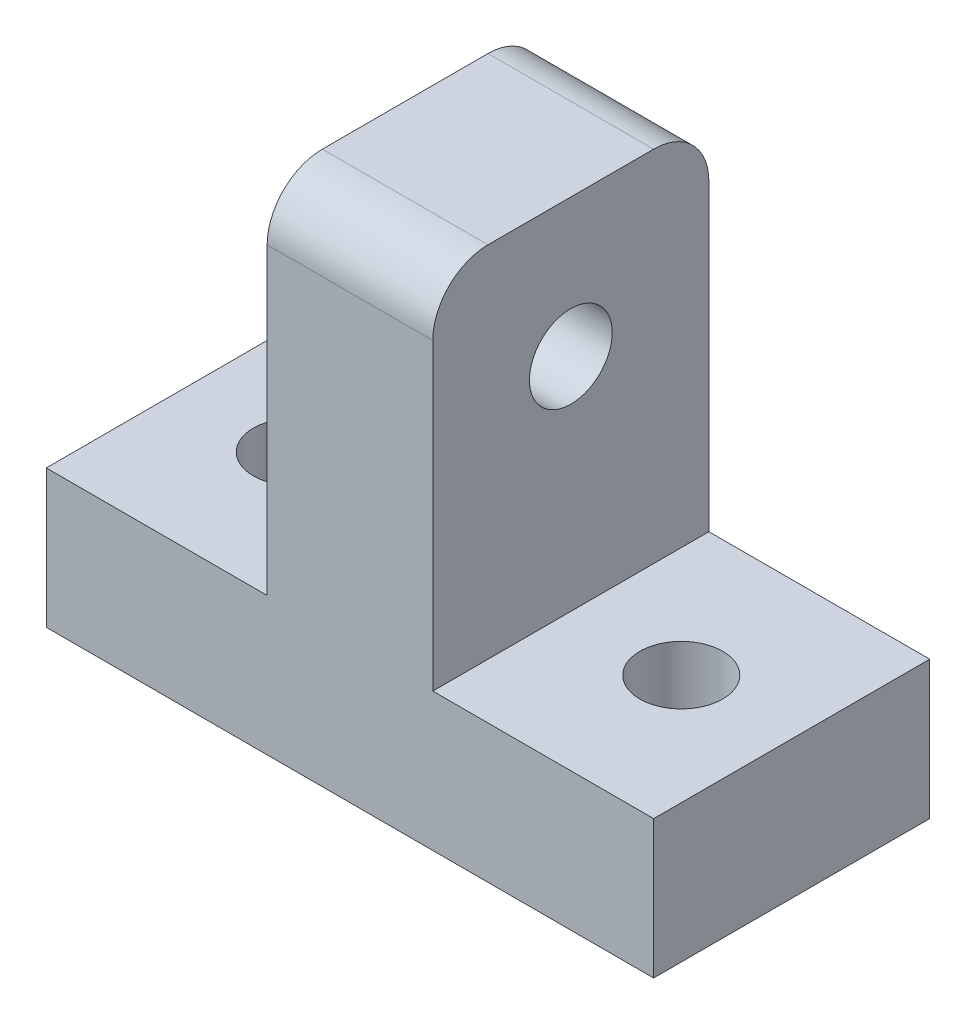
ISO-10303-21;
HEADER;
FILE_DESCRIPTION(('STEP AP214'),'2;1');
FILE_NAME('part.step','',(''),(''),'','','');
FILE_SCHEMA(('AUTOMOTIVE_DESIGN { 1 0 10303 214 1 1 1 1 }'));
ENDSEC;
DATA;
#1=APPLICATION_CONTEXT('core data for automotive mechanical design processes');
#2=APPLICATION_PROTOCOL_DEFINITION('international standard','automotive_design',2000,#1);
#3=PRODUCT_CONTEXT('',#1,'mechanical');
#4=PRODUCT('Part','Part','',(#3));
#5=PRODUCT_RELATED_PRODUCT_CATEGORY('part','',(#4));
#6=PRODUCT_DEFINITION_FORMATION('','',#4);
#7=PRODUCT_DEFINITION_CONTEXT('part definition',#1,'design');
#8=PRODUCT_DEFINITION('design','',#6,#7);
#9=PRODUCT_DEFINITION_SHAPE('','',#8);
#10=(LENGTH_UNIT() NAMED_UNIT(*) SI_UNIT(.MILLI.,.METRE.));
#11=(NAMED_UNIT(*) PLANE_ANGLE_UNIT() SI_UNIT($,.RADIAN.));
#12=(NAMED_UNIT(*) SI_UNIT($,.STERADIAN.) SOLID_ANGLE_UNIT());
#13=UNCERTAINTY_MEASURE_WITH_UNIT(LENGTH_MEASURE(1.E-05),#10,'distance_accuracy_value','');
#14=(GEOMETRIC_REPRESENTATION_CONTEXT(3) GLOBAL_UNCERTAINTY_ASSIGNED_CONTEXT((#13)) GLOBAL_UNIT_ASSIGNED_CONTEXT((#10,
#11,#12)) REPRESENTATION_CONTEXT('',''));
#15=CARTESIAN_POINT('',(0.,0.,0.));
#16=DIRECTION('',(0.,0.,1.));
#17=DIRECTION('',(1.,0.,0.));
#18=AXIS2_PLACEMENT_3D('',#15,#16,#17);
#19=CARTESIAN_POINT('',(0.,5.,0.));
#20=DIRECTION('',(0.,-1.,0.));
#21=DIRECTION('',(0.,0.,-1.));
#22=AXIS2_PLACEMENT_3D('',#19,#20,#21);
#23=PLANE('',#22);
#24=CARTESIAN_POINT('',(7.,5.,0.));
#25=DIRECTION('',(0.,1.,0.));
#26=DIRECTION('',(0.,0.,1.));
#27=AXIS2_PLACEMENT_3D('',#24,#25,#26);
#28=CIRCLE('',#27,1.5);
#29=CARTESIAN_POINT('',(7.,5.,1.5));
#30=VERTEX_POINT('',#29);
#31=EDGE_CURVE('E150',#30,#30,#28,.T.);
#32=ORIENTED_EDGE('',*,*,#31,.F.);
#33=EDGE_LOOP('',(#32));
#34=FACE_BOUND('',#33,.T.);
#35=DIRECTION('',(0.,0.,-1.));
#36=VECTOR('',#35,1.);
#37=CARTESIAN_POINT('',(3.,5.,5.));
#38=LINE('',#37,#36);
#39=CARTESIAN_POINT('',(3.,5.,5.));
#40=VERTEX_POINT('',#39);
#41=CARTESIAN_POINT('',(3.,5.,-5.));
#42=VERTEX_POINT('',#41);
#43=EDGE_CURVE('E135',#40,#42,#38,.T.);
#44=ORIENTED_EDGE('',*,*,#43,.F.);
#45=DIRECTION('',(1.,0.,0.));
#46=VECTOR('',#45,1.);
#47=CARTESIAN_POINT('',(-11.,5.,5.));
#48=LINE('',#47,#46);
#49=CARTESIAN_POINT('',(11.,5.,5.));
#50=VERTEX_POINT('',#49);
#51=EDGE_CURVE('E130',#40,#50,#48,.T.);
#52=ORIENTED_EDGE('',*,*,#51,.T.);
#53=DIRECTION('',(0.,0.,-1.));
#54=VECTOR('',#53,1.);
#55=CARTESIAN_POINT('',(11.,5.,5.));
#56=LINE('',#55,#54);
#57=CARTESIAN_POINT('',(11.,5.,-5.));
#58=VERTEX_POINT('',#57);
#59=EDGE_CURVE('E162',#50,#58,#56,.T.);
#60=ORIENTED_EDGE('',*,*,#59,.T.);
#61=DIRECTION('',(-1.,0.,0.));
#62=VECTOR('',#61,1.);
#63=CARTESIAN_POINT('',(-11.,5.,-5.));
#64=LINE('',#63,#62);
#65=EDGE_CURVE('E167',#58,#42,#64,.T.);
#66=ORIENTED_EDGE('',*,*,#65,.T.);
#67=EDGE_LOOP('',(#44,#52,#60,#66));
#68=FACE_BOUND('',#67,.T.);
#69=ADVANCED_FACE('F32',(#34,#68),#23,.F.);
#70=CARTESIAN_POINT('',(-7.,5.,0.));
#71=DIRECTION('',(0.,1.,0.));
#72=DIRECTION('',(0.,0.,1.));
#73=AXIS2_PLACEMENT_3D('',#70,#71,#72);
#74=CIRCLE('',#73,1.5);
#75=CARTESIAN_POINT('',(-7.,5.,1.5));
#76=VERTEX_POINT('',#75);
#77=EDGE_CURVE('E156',#76,#76,#74,.T.);
#78=ORIENTED_EDGE('',*,*,#77,.F.);
#79=EDGE_LOOP('',(#78));
#80=FACE_BOUND('',#79,.T.);
#81=DIRECTION('',(0.,0.,1.));
#82=VECTOR('',#81,1.);
#83=CARTESIAN_POINT('',(-3.,5.,5.));
#84=LINE('',#83,#82);
#85=CARTESIAN_POINT('',(-3.,5.,-5.));
#86=VERTEX_POINT('',#85);
#87=CARTESIAN_POINT('',(-3.,5.,5.));
#88=VERTEX_POINT('',#87);
#89=EDGE_CURVE('E124',#86,#88,#84,.T.);
#90=ORIENTED_EDGE('',*,*,#89,.F.);
#91=CARTESIAN_POINT('',(-11.,5.,-5.));
#92=VERTEX_POINT('',#91);
#93=EDGE_CURVE('E165',#86,#92,#64,.T.);
#94=ORIENTED_EDGE('',*,*,#93,.T.);
#95=DIRECTION('',(0.,0.,1.));
#96=VECTOR('',#95,1.);
#97=CARTESIAN_POINT('',(-11.,5.,5.));
#98=LINE('',#97,#96);
#99=CARTESIAN_POINT('',(-11.,5.,5.));
#100=VERTEX_POINT('',#99);
#101=EDGE_CURVE('E127',#92,#100,#98,.T.);
#102=ORIENTED_EDGE('',*,*,#101,.T.);
#103=EDGE_CURVE('E113',#100,#88,#48,.T.);
#104=ORIENTED_EDGE('',*,*,#103,.T.);
#105=EDGE_LOOP('',(#90,#94,#102,#104));
#106=FACE_BOUND('',#105,.T.);
#107=ADVANCED_FACE('F123',(#80,#106),#23,.F.);
#108=CARTESIAN_POINT('',(0.,0.,0.));
#109=DIRECTION('',(0.,-1.,0.));
#110=DIRECTION('',(0.,0.,-1.));
#111=AXIS2_PLACEMENT_3D('',#108,#109,#110);
#112=PLANE('',#111);
#113=CARTESIAN_POINT('',(-7.,0.,0.));
#114=DIRECTION('',(0.,1.,0.));
#115=DIRECTION('',(0.,0.,1.));
#116=AXIS2_PLACEMENT_3D('',#113,#114,#115);
#117=CIRCLE('',#116,1.5);
#118=CARTESIAN_POINT('',(-7.,0.,1.5));
#119=VERTEX_POINT('',#118);
#120=EDGE_CURVE('E153',#119,#119,#117,.T.);
#121=ORIENTED_EDGE('',*,*,#120,.T.);
#122=EDGE_LOOP('',(#121));
#123=FACE_BOUND('',#122,.T.);
#124=DIRECTION('',(0.,0.,-1.));
#125=VECTOR('',#124,1.);
#126=CARTESIAN_POINT('',(11.,0.,5.));
#127=LINE('',#126,#125);
#128=CARTESIAN_POINT('',(11.,0.,5.));
#129=VERTEX_POINT('',#128);
#130=CARTESIAN_POINT('',(11.,0.,-5.));
#131=VERTEX_POINT('',#130);
#132=EDGE_CURVE('E159',#129,#131,#127,.T.);
#133=ORIENTED_EDGE('',*,*,#132,.F.);
#134=DIRECTION('',(1.,0.,0.));
#135=VECTOR('',#134,1.);
#136=CARTESIAN_POINT('',(-11.,0.,5.));
#137=LINE('',#136,#135);
#138=CARTESIAN_POINT('',(-11.,0.,5.));
#139=VERTEX_POINT('',#138);
#140=EDGE_CURVE('E166',#139,#129,#137,.T.);
#141=ORIENTED_EDGE('',*,*,#140,.F.);
#142=DIRECTION('',(0.,0.,1.));
#143=VECTOR('',#142,1.);
#144=CARTESIAN_POINT('',(-11.,0.,5.));
#145=LINE('',#144,#143);
#146=CARTESIAN_POINT('',(-11.,0.,-5.));
#147=VERTEX_POINT('',#146);
#148=EDGE_CURVE('E175',#147,#139,#145,.T.);
#149=ORIENTED_EDGE('',*,*,#148,.F.);
#150=DIRECTION('',(-1.,0.,0.));
#151=VECTOR('',#150,1.);
#152=CARTESIAN_POINT('',(-11.,0.,-5.));
#153=LINE('',#152,#151);
#154=EDGE_CURVE('E173',#131,#147,#153,.T.);
#155=ORIENTED_EDGE('',*,*,#154,.F.);
#156=EDGE_LOOP('',(#133,#141,#149,#155));
#157=FACE_BOUND('',#156,.T.);
#158=CARTESIAN_POINT('',(7.,0.,0.));
#159=DIRECTION('',(0.,1.,0.));
#160=DIRECTION('',(0.,0.,1.));
#161=AXIS2_PLACEMENT_3D('',#158,#159,#160);
#162=CIRCLE('',#161,1.5);
#163=CARTESIAN_POINT('',(7.,0.,1.5));
#164=VERTEX_POINT('',#163);
#165=EDGE_CURVE('E149',#164,#164,#162,.T.);
#166=ORIENTED_EDGE('',*,*,#165,.T.);
#167=EDGE_LOOP('',(#166));
#168=FACE_BOUND('',#167,.T.);
#169=ADVANCED_FACE('F217',(#123,#157,#168),#112,.T.);
#170=CARTESIAN_POINT('',(11.,5.,5.));
#171=DIRECTION('',(-1.,0.,0.));
#172=DIRECTION('',(0.,0.,1.));
#173=AXIS2_PLACEMENT_3D('',#170,#171,#172);
#174=PLANE('',#173);
#175=ORIENTED_EDGE('',*,*,#132,.T.);
#176=DIRECTION('',(0.,-1.,0.));
#177=VECTOR('',#176,1.);
#178=CARTESIAN_POINT('',(11.,5.,-5.));
#179=LINE('',#178,#177);
#180=EDGE_CURVE('E185',#58,#131,#179,.T.);
#181=ORIENTED_EDGE('',*,*,#180,.F.);
#182=ORIENTED_EDGE('',*,*,#59,.F.);
#183=DIRECTION('',(0.,-1.,0.));
#184=VECTOR('',#183,1.);
#185=CARTESIAN_POINT('',(11.,5.,5.));
#186=LINE('',#185,#184);
#187=EDGE_CURVE('E129',#50,#129,#186,.T.);
#188=ORIENTED_EDGE('',*,*,#187,.T.);
#189=EDGE_LOOP('',(#175,#181,#182,#188));
#190=FACE_BOUND('',#189,.T.);
#191=ADVANCED_FACE('F221',(#190),#174,.F.);
#192=CARTESIAN_POINT('',(-11.,5.,-5.));
#193=DIRECTION('',(0.,0.,1.));
#194=DIRECTION('',(1.,0.,0.));
#195=AXIS2_PLACEMENT_3D('',#192,#193,#194);
#196=PLANE('',#195);
#197=DIRECTION('',(0.,-1.,0.));
#198=VECTOR('',#197,1.);
#199=CARTESIAN_POINT('',(-3.,18.,-5.));
#200=LINE('',#199,#198);
#201=CARTESIAN_POINT('',(-3.,16.,-5.));
#202=VERTEX_POINT('',#201);
#203=EDGE_CURVE('E118',#202,#86,#200,.T.);
#204=ORIENTED_EDGE('',*,*,#203,.F.);
#205=DIRECTION('',(-1.,0.,0.));
#206=VECTOR('',#205,1.);
#207=CARTESIAN_POINT('',(-11.,16.,-5.));
#208=LINE('',#207,#206);
#209=CARTESIAN_POINT('',(3.,16.,-5.));
#210=VERTEX_POINT('',#209);
#211=EDGE_CURVE('E55',#202,#210,#208,.F.);
#212=ORIENTED_EDGE('',*,*,#211,.T.);
#213=DIRECTION('',(0.,-1.,0.));
#214=VECTOR('',#213,1.);
#215=CARTESIAN_POINT('',(3.,18.,-5.));
#216=LINE('',#215,#214);
#217=EDGE_CURVE('E147',#210,#42,#216,.T.);
#218=ORIENTED_EDGE('',*,*,#217,.T.);
#219=ORIENTED_EDGE('',*,*,#65,.F.);
#220=ORIENTED_EDGE('',*,*,#180,.T.);
#221=ORIENTED_EDGE('',*,*,#154,.T.);
#222=DIRECTION('',(0.,-1.,0.));
#223=VECTOR('',#222,1.);
#224=CARTESIAN_POINT('',(-11.,5.,-5.));
#225=LINE('',#224,#223);
#226=EDGE_CURVE('E182',#92,#147,#225,.T.);
#227=ORIENTED_EDGE('',*,*,#226,.F.);
#228=ORIENTED_EDGE('',*,*,#93,.F.);
#229=EDGE_LOOP('',(#204,#212,#218,#219,#220,#221,#227,#228));
#230=FACE_BOUND('',#229,.T.);
#231=ADVANCED_FACE('F208',(#230),#196,.F.);
#232=CARTESIAN_POINT('',(-11.,5.,5.));
#233=DIRECTION('',(1.,0.,0.));
#234=DIRECTION('',(0.,0.,-1.));
#235=AXIS2_PLACEMENT_3D('',#232,#233,#234);
#236=PLANE('',#235);
#237=ORIENTED_EDGE('',*,*,#148,.T.);
#238=DIRECTION('',(0.,-1.,0.));
#239=VECTOR('',#238,1.);
#240=CARTESIAN_POINT('',(-11.,5.,5.));
#241=LINE('',#240,#239);
#242=EDGE_CURVE('E180',#100,#139,#241,.T.);
#243=ORIENTED_EDGE('',*,*,#242,.F.);
#244=ORIENTED_EDGE('',*,*,#101,.F.);
#245=ORIENTED_EDGE('',*,*,#226,.T.);
#246=EDGE_LOOP('',(#237,#243,#244,#245));
#247=FACE_BOUND('',#246,.T.);
#248=ADVANCED_FACE('F212',(#247),#236,.F.);
#249=CARTESIAN_POINT('',(-11.,5.,5.));
#250=DIRECTION('',(0.,0.,-1.));
#251=DIRECTION('',(-1.,0.,0.));
#252=AXIS2_PLACEMENT_3D('',#249,#250,#251);
#253=PLANE('',#252);
#254=DIRECTION('',(0.,-1.,0.));
#255=VECTOR('',#254,1.);
#256=CARTESIAN_POINT('',(3.,18.,5.));
#257=LINE('',#256,#255);
#258=CARTESIAN_POINT('',(3.,16.,5.));
#259=VERTEX_POINT('',#258);
#260=EDGE_CURVE('E119',#259,#40,#257,.T.);
#261=ORIENTED_EDGE('',*,*,#260,.F.);
#262=DIRECTION('',(1.,0.,0.));
#263=VECTOR('',#262,1.);
#264=CARTESIAN_POINT('',(-11.,16.,5.));
#265=LINE('',#264,#263);
#266=CARTESIAN_POINT('',(-3.,16.,5.));
#267=VERTEX_POINT('',#266);
#268=EDGE_CURVE('E11',#259,#267,#265,.F.);
#269=ORIENTED_EDGE('',*,*,#268,.T.);
#270=DIRECTION('',(0.,-1.,0.));
#271=VECTOR('',#270,1.);
#272=CARTESIAN_POINT('',(-3.,18.,5.));
#273=LINE('',#272,#271);
#274=EDGE_CURVE('E109',#267,#88,#273,.T.);
#275=ORIENTED_EDGE('',*,*,#274,.T.);
#276=ORIENTED_EDGE('',*,*,#103,.F.);
#277=ORIENTED_EDGE('',*,*,#242,.T.);
#278=ORIENTED_EDGE('',*,*,#140,.T.);
#279=ORIENTED_EDGE('',*,*,#187,.F.);
#280=ORIENTED_EDGE('',*,*,#51,.F.);
#281=EDGE_LOOP('',(#261,#269,#275,#276,#277,#278,#279,#280));
#282=FACE_BOUND('',#281,.T.);
#283=ADVANCED_FACE('F111',(#282),#253,.F.);
#284=CARTESIAN_POINT('',(-7.,5.,0.));
#285=DIRECTION('',(0.,-1.,0.));
#286=DIRECTION('',(0.,0.,-1.));
#287=AXIS2_PLACEMENT_3D('',#284,#285,#286);
#288=CYLINDRICAL_SURFACE('',#287,1.5);
#289=ORIENTED_EDGE('',*,*,#77,.T.);
#290=EDGE_LOOP('',(#289));
#291=FACE_BOUND('',#290,.T.);
#292=ORIENTED_EDGE('',*,*,#120,.F.);
#293=EDGE_LOOP('',(#292));
#294=FACE_BOUND('',#293,.T.);
#295=ADVANCED_FACE('F236',(#291,#294),#288,.F.);
#296=CARTESIAN_POINT('',(7.,5.,0.));
#297=DIRECTION('',(0.,-1.,0.));
#298=DIRECTION('',(0.,0.,-1.));
#299=AXIS2_PLACEMENT_3D('',#296,#297,#298);
#300=CYLINDRICAL_SURFACE('',#299,1.5);
#301=ORIENTED_EDGE('',*,*,#31,.T.);
#302=EDGE_LOOP('',(#301));
#303=FACE_BOUND('',#302,.T.);
#304=ORIENTED_EDGE('',*,*,#165,.F.);
#305=EDGE_LOOP('',(#304));
#306=FACE_BOUND('',#305,.T.);
#307=ADVANCED_FACE('F268',(#303,#306),#300,.F.);
#308=CARTESIAN_POINT('',(3.,18.,5.));
#309=DIRECTION('',(-1.,0.,0.));
#310=DIRECTION('',(0.,0.,1.));
#311=AXIS2_PLACEMENT_3D('',#308,#309,#310);
#312=PLANE('',#311);
#313=CARTESIAN_POINT('',(3.,13.,0.));
#314=DIRECTION('',(1.,0.,0.));
#315=DIRECTION('',(0.,0.,-1.));
#316=AXIS2_PLACEMENT_3D('',#313,#314,#315);
#317=CIRCLE('',#316,1.5);
#318=CARTESIAN_POINT('',(3.,13.,-1.5));
#319=VERTEX_POINT('',#318);
#320=EDGE_CURVE('E370',#319,#319,#317,.T.);
#321=ORIENTED_EDGE('',*,*,#320,.F.);
#322=EDGE_LOOP('',(#321));
#323=FACE_BOUND('',#322,.T.);
#324=ORIENTED_EDGE('',*,*,#217,.F.);
#325=CARTESIAN_POINT('',(3.,16.,-3.));
#326=DIRECTION('',(-1.,0.,0.));
#327=DIRECTION('',(0.,0.,1.));
#328=AXIS2_PLACEMENT_3D('',#325,#326,#327);
#329=CIRCLE('',#328,2.);
#330=CARTESIAN_POINT('',(3.,18.,-3.));
#331=VERTEX_POINT('',#330);
#332=EDGE_CURVE('E40',#210,#331,#329,.F.);
#333=ORIENTED_EDGE('',*,*,#332,.T.);
#334=DIRECTION('',(0.,0.,-1.));
#335=VECTOR('',#334,1.);
#336=CARTESIAN_POINT('',(3.,18.,5.));
#337=LINE('',#336,#335);
#338=CARTESIAN_POINT('',(3.,18.,3.));
#339=VERTEX_POINT('',#338);
#340=EDGE_CURVE('E134',#339,#331,#337,.T.);
#341=ORIENTED_EDGE('',*,*,#340,.F.);
#342=CARTESIAN_POINT('',(3.,16.,3.));
#343=DIRECTION('',(-1.,0.,0.));
#344=DIRECTION('',(0.,0.,1.));
#345=AXIS2_PLACEMENT_3D('',#342,#343,#344);
#346=CIRCLE('',#345,2.);
#347=EDGE_CURVE('E47',#339,#259,#346,.F.);
#348=ORIENTED_EDGE('',*,*,#347,.T.);
#349=ORIENTED_EDGE('',*,*,#260,.T.);
#350=ORIENTED_EDGE('',*,*,#43,.T.);
#351=EDGE_LOOP('',(#324,#333,#341,#348,#349,#350));
#352=FACE_BOUND('',#351,.T.);
#353=ADVANCED_FACE('F200',(#323,#352),#312,.F.);
#354=CARTESIAN_POINT('',(-3.,18.,5.));
#355=DIRECTION('',(1.,0.,0.));
#356=DIRECTION('',(0.,0.,-1.));
#357=AXIS2_PLACEMENT_3D('',#354,#355,#356);
#358=PLANE('',#357);
#359=CARTESIAN_POINT('',(-3.,13.,0.));
#360=DIRECTION('',(1.,0.,0.));
#361=DIRECTION('',(0.,0.,-1.));
#362=AXIS2_PLACEMENT_3D('',#359,#360,#361);
#363=CIRCLE('',#362,1.5);
#364=CARTESIAN_POINT('',(-3.,13.,-1.5));
#365=VERTEX_POINT('',#364);
#366=EDGE_CURVE('E141',#365,#365,#363,.F.);
#367=ORIENTED_EDGE('',*,*,#366,.F.);
#368=EDGE_LOOP('',(#367));
#369=FACE_BOUND('',#368,.T.);
#370=DIRECTION('',(0.,0.,1.));
#371=VECTOR('',#370,1.);
#372=CARTESIAN_POINT('',(-3.,18.,5.));
#373=LINE('',#372,#371);
#374=CARTESIAN_POINT('',(-3.,18.,-3.));
#375=VERTEX_POINT('',#374);
#376=CARTESIAN_POINT('',(-3.,18.,3.));
#377=VERTEX_POINT('',#376);
#378=EDGE_CURVE('E138',#375,#377,#373,.T.);
#379=ORIENTED_EDGE('',*,*,#378,.F.);
#380=CARTESIAN_POINT('',(-3.,16.,-3.));
#381=DIRECTION('',(1.,0.,0.));
#382=DIRECTION('',(0.,0.,-1.));
#383=AXIS2_PLACEMENT_3D('',#380,#381,#382);
#384=CIRCLE('',#383,2.);
#385=EDGE_CURVE('E196',#375,#202,#384,.F.);
#386=ORIENTED_EDGE('',*,*,#385,.T.);
#387=ORIENTED_EDGE('',*,*,#203,.T.);
#388=ORIENTED_EDGE('',*,*,#89,.T.);
#389=ORIENTED_EDGE('',*,*,#274,.F.);
#390=CARTESIAN_POINT('',(-3.,16.,3.));
#391=DIRECTION('',(1.,0.,0.));
#392=DIRECTION('',(0.,0.,-1.));
#393=AXIS2_PLACEMENT_3D('',#390,#391,#392);
#394=CIRCLE('',#393,2.);
#395=EDGE_CURVE('E194',#267,#377,#394,.F.);
#396=ORIENTED_EDGE('',*,*,#395,.T.);
#397=EDGE_LOOP('',(#379,#386,#387,#388,#389,#396));
#398=FACE_BOUND('',#397,.T.);
#399=ADVANCED_FACE('F133',(#369,#398),#358,.F.);
#400=CARTESIAN_POINT('',(0.,18.,0.));
#401=DIRECTION('',(0.,-1.,0.));
#402=DIRECTION('',(0.,0.,-1.));
#403=AXIS2_PLACEMENT_3D('',#400,#401,#402);
#404=PLANE('',#403);
#405=ORIENTED_EDGE('',*,*,#340,.T.);
#406=DIRECTION('',(-1.,0.,0.));
#407=VECTOR('',#406,1.);
#408=CARTESIAN_POINT('',(0.,18.,-3.));
#409=LINE('',#408,#407);
#410=EDGE_CURVE('E191',#331,#375,#409,.T.);
#411=ORIENTED_EDGE('',*,*,#410,.T.);
#412=ORIENTED_EDGE('',*,*,#378,.T.);
#413=DIRECTION('',(1.,0.,0.));
#414=VECTOR('',#413,1.);
#415=CARTESIAN_POINT('',(0.,18.,3.));
#416=LINE('',#415,#414);
#417=EDGE_CURVE('E188',#377,#339,#416,.T.);
#418=ORIENTED_EDGE('',*,*,#417,.T.);
#419=EDGE_LOOP('',(#405,#411,#412,#418));
#420=FACE_BOUND('',#419,.T.);
#421=ADVANCED_FACE('F204',(#420),#404,.F.);
#422=CARTESIAN_POINT('',(-11.001,13.,0.));
#423=DIRECTION('',(1.,0.,0.));
#424=DIRECTION('',(0.,0.,-1.));
#425=AXIS2_PLACEMENT_3D('',#422,#423,#424);
#426=CYLINDRICAL_SURFACE('',#425,1.5);
#427=ORIENTED_EDGE('',*,*,#320,.T.);
#428=EDGE_LOOP('',(#427));
#429=FACE_BOUND('',#428,.T.);
#430=ORIENTED_EDGE('',*,*,#366,.T.);
#431=EDGE_LOOP('',(#430));
#432=FACE_BOUND('',#431,.T.);
#433=ADVANCED_FACE('F249',(#429,#432),#426,.F.);
#434=CARTESIAN_POINT('',(0.,16.,-3.));
#435=DIRECTION('',(-1.,0.,0.));
#436=DIRECTION('',(0.,0.,1.));
#437=AXIS2_PLACEMENT_3D('',#434,#435,#436);
#438=CYLINDRICAL_SURFACE('',#437,2.);
#439=ORIENTED_EDGE('',*,*,#332,.F.);
#440=ORIENTED_EDGE('',*,*,#211,.F.);
#441=ORIENTED_EDGE('',*,*,#385,.F.);
#442=ORIENTED_EDGE('',*,*,#410,.F.);
#443=EDGE_LOOP('',(#439,#440,#441,#442));
#444=FACE_BOUND('',#443,.T.);
#445=ADVANCED_FACE('F207',(#444),#438,.T.);
#446=CARTESIAN_POINT('',(0.,16.,3.));
#447=DIRECTION('',(1.,0.,0.));
#448=DIRECTION('',(0.,0.,-1.));
#449=AXIS2_PLACEMENT_3D('',#446,#447,#448);
#450=CYLINDRICAL_SURFACE('',#449,2.);
#451=ORIENTED_EDGE('',*,*,#395,.F.);
#452=ORIENTED_EDGE('',*,*,#268,.F.);
#453=ORIENTED_EDGE('',*,*,#347,.F.);
#454=ORIENTED_EDGE('',*,*,#417,.F.);
#455=EDGE_LOOP('',(#451,#452,#453,#454));
#456=FACE_BOUND('',#455,.T.);
#457=ADVANCED_FACE('F34',(#456),#450,.T.);
#458=CLOSED_SHELL('',(#69,#107,#169,#191,#231,#248,#283,#295,#307,#353,#399,#421,#433,#445,#457));
#459=MANIFOLD_SOLID_BREP('B2',#458);
#460=ADVANCED_BREP_SHAPE_REPRESENTATION('',(#18,#459),#14);
#461=SHAPE_DEFINITION_REPRESENTATION(#9,#460);
ENDSEC;
END-ISO-10303-21;
